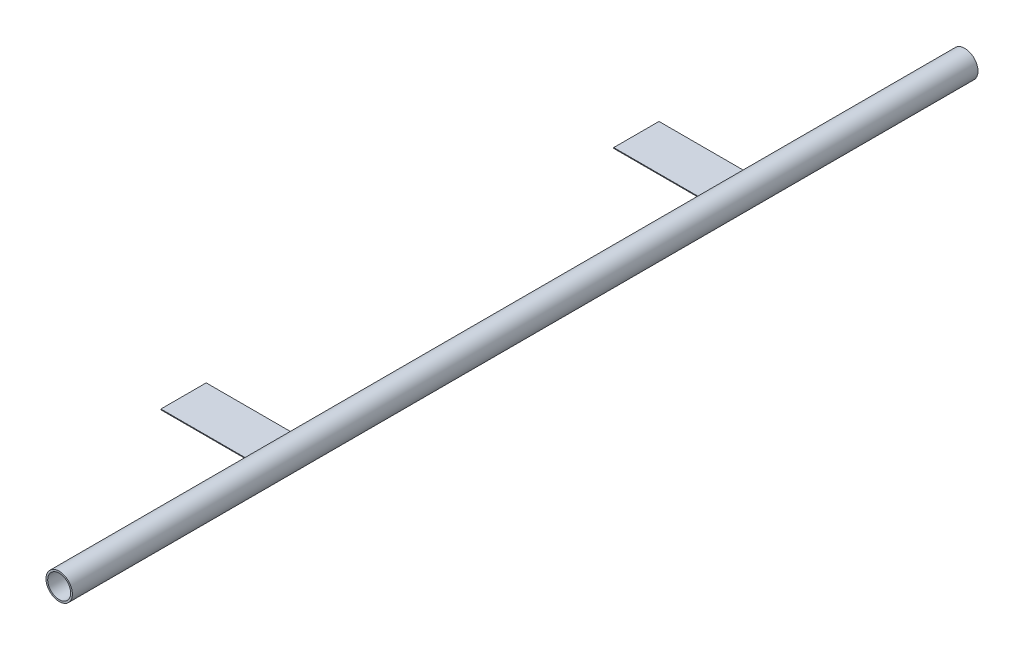
ISO-10303-21;
HEADER;
FILE_DESCRIPTION(('STEP AP214'),'2;1');
FILE_NAME('part.step','',(''),(''),'','','');
FILE_SCHEMA(('AUTOMOTIVE_DESIGN { 1 0 10303 214 1 1 1 1 }'));
ENDSEC;
DATA;
#1=APPLICATION_CONTEXT('core data for automotive mechanical design processes');
#2=APPLICATION_PROTOCOL_DEFINITION('international standard','automotive_design',2000,#1);
#3=PRODUCT_CONTEXT('',#1,'mechanical');
#4=PRODUCT('Part','Part','',(#3));
#5=PRODUCT_RELATED_PRODUCT_CATEGORY('part','',(#4));
#6=PRODUCT_DEFINITION_FORMATION('','',#4);
#7=PRODUCT_DEFINITION_CONTEXT('part definition',#1,'design');
#8=PRODUCT_DEFINITION('design','',#6,#7);
#9=PRODUCT_DEFINITION_SHAPE('','',#8);
#10=(LENGTH_UNIT() NAMED_UNIT(*) SI_UNIT(.MILLI.,.METRE.));
#11=(NAMED_UNIT(*) PLANE_ANGLE_UNIT() SI_UNIT($,.RADIAN.));
#12=(NAMED_UNIT(*) SI_UNIT($,.STERADIAN.) SOLID_ANGLE_UNIT());
#13=UNCERTAINTY_MEASURE_WITH_UNIT(LENGTH_MEASURE(1.E-05),#10,'distance_accuracy_value','');
#14=(GEOMETRIC_REPRESENTATION_CONTEXT(3) GLOBAL_UNCERTAINTY_ASSIGNED_CONTEXT((#13)) GLOBAL_UNIT_ASSIGNED_CONTEXT((#10,
#11,#12)) REPRESENTATION_CONTEXT('',''));
#15=CARTESIAN_POINT('',(0.,0.,0.));
#16=DIRECTION('',(0.,0.,1.));
#17=DIRECTION('',(1.,0.,0.));
#18=AXIS2_PLACEMENT_3D('',#15,#16,#17);
#19=CARTESIAN_POINT('',(0.,0.,3048.));
#20=DIRECTION('',(0.,0.,-1.));
#21=DIRECTION('',(-1.,0.,0.));
#22=AXIS2_PLACEMENT_3D('',#19,#20,#21);
#23=CYLINDRICAL_SURFACE('',#22,44.45);
#24=CARTESIAN_POINT('',(0.,0.,2209.8));
#25=DIRECTION('',(0.,0.,1.));
#26=DIRECTION('',(1.,0.,0.));
#27=AXIS2_PLACEMENT_3D('',#24,#25,#26);
#28=CIRCLE('',#27,44.45);
#29=CARTESIAN_POINT('',(-44.3773692325266,2.54,2209.8));
#30=VERTEX_POINT('',#29);
#31=CARTESIAN_POINT('',(-44.45,0.,2209.8));
#32=VERTEX_POINT('',#31);
#33=EDGE_CURVE('E48',#30,#32,#28,.T.);
#34=ORIENTED_EDGE('',*,*,#33,.F.);
#35=DIRECTION('',(0.,0.,-1.));
#36=VECTOR('',#35,1.);
#37=CARTESIAN_POINT('',(-44.3773692325266,2.54,3048.));
#38=LINE('',#37,#36);
#39=CARTESIAN_POINT('',(-44.3773692325266,2.54,2362.2));
#40=VERTEX_POINT('',#39);
#41=EDGE_CURVE('E11',#30,#40,#38,.F.);
#42=ORIENTED_EDGE('',*,*,#41,.T.);
#43=CARTESIAN_POINT('',(0.,0.,2362.2));
#44=DIRECTION('',(0.,0.,-1.));
#45=DIRECTION('',(-1.,0.,0.));
#46=AXIS2_PLACEMENT_3D('',#43,#44,#45);
#47=CIRCLE('',#46,44.45);
#48=CARTESIAN_POINT('',(-44.45,0.,2362.2));
#49=VERTEX_POINT('',#48);
#50=EDGE_CURVE('E129',#49,#40,#47,.T.);
#51=ORIENTED_EDGE('',*,*,#50,.F.);
#52=DIRECTION('',(0.,0.,-1.));
#53=VECTOR('',#52,1.);
#54=CARTESIAN_POINT('',(-44.45,0.,3048.));
#55=LINE('',#54,#53);
#56=EDGE_CURVE('E111',#32,#49,#55,.F.);
#57=ORIENTED_EDGE('',*,*,#56,.F.);
#58=EDGE_LOOP('',(#34,#42,#51,#57));
#59=FACE_BOUND('',#58,.T.);
#60=CARTESIAN_POINT('',(0.,0.,0.));
#61=DIRECTION('',(0.,0.,1.));
#62=DIRECTION('',(1.,0.,0.));
#63=AXIS2_PLACEMENT_3D('',#60,#61,#62);
#64=CIRCLE('',#63,44.45);
#65=CARTESIAN_POINT('',(44.45,0.,0.));
#66=VERTEX_POINT('',#65);
#67=EDGE_CURVE('E190',#66,#66,#64,.T.);
#68=ORIENTED_EDGE('',*,*,#67,.T.);
#69=EDGE_LOOP('',(#68));
#70=FACE_BOUND('',#69,.T.);
#71=CARTESIAN_POINT('',(0.,0.,3048.));
#72=DIRECTION('',(0.,0.,1.));
#73=DIRECTION('',(1.,0.,0.));
#74=AXIS2_PLACEMENT_3D('',#71,#72,#73);
#75=CIRCLE('',#74,44.45);
#76=CARTESIAN_POINT('',(44.45,0.,3048.));
#77=VERTEX_POINT('',#76);
#78=EDGE_CURVE('E192',#77,#77,#75,.T.);
#79=ORIENTED_EDGE('',*,*,#78,.F.);
#80=EDGE_LOOP('',(#79));
#81=FACE_BOUND('',#80,.T.);
#82=CARTESIAN_POINT('',(-44.45,0.,1816.1));
#83=CARTESIAN_POINT('',(-44.4499994094419,0.349124976126197,1816.10000095291));
#84=CARTESIAN_POINT('',(-44.4458768510917,0.698267379448736,1816.11440821225));
#85=CARTESIAN_POINT('',(-44.4294988891921,1.39400101326506,1816.17191143551));
#86=CARTESIAN_POINT('',(-44.4172429435988,1.74059207216968,1816.2150093115));
#87=CARTESIAN_POINT('',(-44.3849309543297,2.42880969481117,1816.3295304269));
#88=CARTESIAN_POINT('',(-44.364872323751,2.77043457305225,1816.40096306058));
#89=CARTESIAN_POINT('',(-44.3175037645278,3.44616991307207,1816.57153546925));
#90=CARTESIAN_POINT('',(-44.2901939292375,3.78028047153231,1816.67067488754));
#91=CARTESIAN_POINT('',(-44.2291042018982,4.43822660429691,1816.89567907866));
#92=CARTESIAN_POINT('',(-44.1953335533795,4.76207609677702,1817.02150569753));
#93=CARTESIAN_POINT('',(-44.1221947878867,5.39785439954446,1817.29897943833));
#94=CARTESIAN_POINT('',(-44.0828266592826,5.70978318506237,1817.4506266139));
#95=CARTESIAN_POINT('',(-43.9995301115296,6.31969833851184,1817.77859838217));
#96=CARTESIAN_POINT('',(-43.9556021723455,6.61768616908493,1817.95492037829));
#97=CARTESIAN_POINT('',(-43.8643066669765,7.19801545909216,1818.33108448846));
#98=CARTESIAN_POINT('',(-43.8169378776995,7.48035129133255,1818.53093498182));
#99=CARTESIAN_POINT('',(-43.7188564895558,8.03398876919602,1818.95774188317));
#100=CARTESIAN_POINT('',(-43.6680914777267,8.30487534689932,1819.18522479941));
#101=CARTESIAN_POINT('',(-43.5656228311395,8.82664787461659,1819.66188443381));
#102=CARTESIAN_POINT('',(-43.5139191817067,9.07753351160177,1819.91106149136));
#103=CARTESIAN_POINT('',(-43.4109616296781,9.55778499885215,1820.42959599436));
#104=CARTESIAN_POINT('',(-43.3597078760072,9.78714395005912,1820.69895986004));
#105=CARTESIAN_POINT('',(-43.2590960141507,10.2226739561877,1821.25600299161));
#106=CARTESIAN_POINT('',(-43.2097372555813,10.4288530144176,1821.5436758819));
#107=CARTESIAN_POINT('',(-43.1133104450408,10.8206517530001,1822.14163409086));
#108=CARTESIAN_POINT('',(-43.0663093490097,11.0057683434778,1822.45226018551));
#109=CARTESIAN_POINT('',(-42.9771103716092,11.3490951717419,1823.08871509373));
#110=CARTESIAN_POINT('',(-42.9349125716722,11.5073049533879,1823.41454416491));
#111=CARTESIAN_POINT('',(-42.8566280826421,11.7955178832089,1824.079099031));
#112=CARTESIAN_POINT('',(-42.8205403693624,11.9255257596807,1824.41782265281));
#113=CARTESIAN_POINT('',(-42.7556140069083,12.15624747597,1825.10577976983));
#114=CARTESIAN_POINT('',(-42.7267751257516,12.256962253263,1825.45501292831));
#115=CARTESIAN_POINT('',(-42.6779200787544,12.4259881778146,1826.15232116981));
#116=CARTESIAN_POINT('',(-42.6576967213501,12.4950637062778,1826.50019650238));
#117=CARTESIAN_POINT('',(-42.6256636004402,12.6039094246941,1827.20088726731));
#118=CARTESIAN_POINT('',(-42.613853705581,12.6436800721639,1827.55370262245));
#119=CARTESIAN_POINT('',(-42.5990288336653,12.6935385863915,1828.26154230964));
#120=CARTESIAN_POINT('',(-42.5960121955998,12.7036320590449,1828.6165662118));
#121=CARTESIAN_POINT('',(-42.5988671692687,12.6940554344367,1829.32617273209));
#122=CARTESIAN_POINT('',(-42.6047386110387,12.6743859063251,1829.68075535852));
#123=CARTESIAN_POINT('',(-42.6248461041546,12.6065929482021,1830.37530652146));
#124=CARTESIAN_POINT('',(-42.6388044334019,12.5594139260849,1830.71537580515));
#125=CARTESIAN_POINT('',(-42.6744420893893,12.4377852719432,1831.39017990467));
#126=CARTESIAN_POINT('',(-42.69612122426,12.3633363176016,1831.72491485284));
#127=CARTESIAN_POINT('',(-42.7465630956684,12.1877878155933,1832.38679028464));
#128=CARTESIAN_POINT('',(-42.7753262709506,12.0866866172138,1832.71393029651));
#129=CARTESIAN_POINT('',(-42.8391068819173,11.8586435311775,1833.3584462346));
#130=CARTESIAN_POINT('',(-42.8741244435022,11.7317011233318,1833.67582196411));
#131=CARTESIAN_POINT('',(-42.9499069977302,11.4511725162324,1834.30273229123));
#132=CARTESIAN_POINT('',(-42.9907390082692,11.2972699891572,1834.61211718375));
#133=CARTESIAN_POINT('',(-43.0766659551307,10.9650704733272,1835.21687284538));
#134=CARTESIAN_POINT('',(-43.1217609098922,10.7867733790536,1835.51224355387));
#135=CARTESIAN_POINT('',(-43.214993897272,10.406970260801,1836.08722895521));
#136=CARTESIAN_POINT('',(-43.2631324581298,10.2054602030313,1836.36684089701));
#137=CARTESIAN_POINT('',(-43.3611669260551,9.78055381197331,1836.90859350823));
#138=CARTESIAN_POINT('',(-43.4110629161041,9.55715644433016,1837.17073335097));
#139=CARTESIAN_POINT('',(-43.5132000491619,9.08104593080377,1837.68549972803));
#140=CARTESIAN_POINT('',(-43.5654586735929,8.82754496785317,1837.93739474111));
#141=CARTESIAN_POINT('',(-43.6690149791473,8.30011122116982,1838.41902798474));
#142=CARTESIAN_POINT('',(-43.720312635767,8.02617791731918,1838.6487656509));
#143=CARTESIAN_POINT('',(-43.820535419367,7.45961950600793,1839.08454202978));
#144=CARTESIAN_POINT('',(-43.8694603585998,7.1669929236237,1839.29057886887));
#145=CARTESIAN_POINT('',(-43.9635801984794,6.56497658212721,1839.67745832442));
#146=CARTESIAN_POINT('',(-44.0087752550435,6.25558752461949,1839.85830199423));
#147=CARTESIAN_POINT('',(-44.0944227351352,5.62029168298145,1840.19439265663));
#148=CARTESIAN_POINT('',(-44.1348468973658,5.29430139395536,1840.34948913568));
#149=CARTESIAN_POINT('',(-44.2095048454722,4.62968546304167,1840.63158194462));
#150=CARTESIAN_POINT('',(-44.2437385808783,4.29105971816588,1840.75857804542));
#151=CARTESIAN_POINT('',(-44.3050220573182,3.60368470981783,1840.98335664155));
#152=CARTESIAN_POINT('',(-44.3320732695448,3.25493753577249,1841.08114511999));
#153=CARTESIAN_POINT('',(-44.3782094620071,2.54986544882095,1841.24665830674));
#154=CARTESIAN_POINT('',(-44.3972947038901,2.19354078520625,1841.3143840025));
#155=CARTESIAN_POINT('',(-44.4264496428669,1.48784186434864,1841.41741981067));
#156=CARTESIAN_POINT('',(-44.4367947192116,1.13862340982308,1841.4537210202));
#157=CARTESIAN_POINT('',(-44.449219448824,0.438235911845152,1841.49728516654));
#158=CARTESIAN_POINT('',(-44.4512992830477,0.0870669112658555,1841.50454873909));
#159=CARTESIAN_POINT('',(-44.4471356491359,-0.614576730539139,1841.48997298099));
#160=CARTESIAN_POINT('',(-44.4408930889279,-0.965051443330635,1841.46813682496));
#161=CARTESIAN_POINT('',(-44.4202607169409,-1.6627507352569,1841.39556551081));
#162=CARTESIAN_POINT('',(-44.405870954192,-2.00997533393818,1841.34483052659));
#163=CARTESIAN_POINT('',(-44.3697139971179,-2.69168014363096,1841.21622885623));
#164=CARTESIAN_POINT('',(-44.3481016767682,-3.0262761132517,1841.13893085264));
#165=CARTESIAN_POINT('',(-44.2980120524893,-3.68762891285117,1840.95767053001));
#166=CARTESIAN_POINT('',(-44.2695348678046,-4.0143858788869,1840.85370867411));
#167=CARTESIAN_POINT('',(-44.2064556850375,-4.6579319058965,1840.61993587892));
#168=CARTESIAN_POINT('',(-44.1718531842887,-4.97472014628462,1840.49012281806));
#169=CARTESIAN_POINT('',(-44.0974155664936,-5.59628710010197,1840.20563016376));
#170=CARTESIAN_POINT('',(-44.057580330561,-5.90106554046763,1840.05095000532));
#171=CARTESIAN_POINT('',(-43.9727820607284,-6.50318130847991,1839.71421894474));
#172=CARTESIAN_POINT('',(-43.9277267244167,-6.80021493866368,1839.53164822773));
#173=CARTESIAN_POINT('',(-43.8343957494089,-7.37793229184965,1839.14298441699));
#174=CARTESIAN_POINT('',(-43.7861200738095,-7.6586158274189,1838.93689105369));
#175=CARTESIAN_POINT('',(-43.6876006736836,-8.20196986913567,1838.50250967738));
#176=CARTESIAN_POINT('',(-43.6373565600862,-8.46463678570362,1838.27421726327));
#177=CARTESIAN_POINT('',(-43.5362235590521,-8.97029737595411,1837.79692430348));
#178=CARTESIAN_POINT('',(-43.4853346608591,-9.21329072094242,1837.54792341196));
#179=CARTESIAN_POINT('',(-43.3825966864726,-9.68571890573686,1837.02227294292));
#180=CARTESIAN_POINT('',(-43.3307707492019,-9.91444903884761,1836.74498492452));
#181=CARTESIAN_POINT('',(-43.2293385347126,-10.3477690223316,1836.1717549127));
#182=CARTESIAN_POINT('',(-43.1797323108092,-10.5523582930594,1835.87581247163));
#183=CARTESIAN_POINT('',(-43.0841849919749,-10.9359308837687,1835.26720891409));
#184=CARTESIAN_POINT('',(-43.0382438608983,-11.1149144562915,1834.95454796256));
#185=CARTESIAN_POINT('',(-42.9513998621207,-11.4459182497445,1834.3145920062));
#186=CARTESIAN_POINT('',(-42.9104969127041,-11.5979389080102,1833.98729723884));
#187=CARTESIAN_POINT('',(-42.8351885726294,-11.8730521459899,1833.32210967949));
#188=CARTESIAN_POINT('',(-42.8007496167686,-11.9962950226126,1832.98428289445));
#189=CARTESIAN_POINT('',(-42.7391791571089,-12.2138389167996,1832.29877734452));
#190=CARTESIAN_POINT('',(-42.7120476521782,-12.3081399388466,1831.95109858116));
#191=CARTESIAN_POINT('',(-42.6659711358513,-12.4669263138403,1831.24855249586));
#192=CARTESIAN_POINT('',(-42.6470240454284,-12.531419239011,1830.89368702352));
#193=CARTESIAN_POINT('',(-42.6179298742622,-12.6300122203345,1830.1794048148));
#194=CARTESIAN_POINT('',(-42.6077824978794,-12.6641132975483,1829.81998823172));
#195=CARTESIAN_POINT('',(-42.5968346596554,-12.7008865356925,1829.11304156205));
#196=CARTESIAN_POINT('',(-42.5956955256492,-12.7046975064124,1828.76557546139));
#197=CARTESIAN_POINT('',(-42.6019096617444,-12.6838446009738,1828.07158139496));
#198=CARTESIAN_POINT('',(-42.6092627067403,-12.6591814795887,1827.72505340456));
#199=CARTESIAN_POINT('',(-42.6322332286169,-12.5816063588106,1827.03546965475));
#200=CARTESIAN_POINT('',(-42.6478503803785,-12.5286954707154,1826.69241375927));
#201=CARTESIAN_POINT('',(-42.6868712914339,-12.3950939121327,1826.01220854341));
#202=CARTESIAN_POINT('',(-42.7102750891235,-12.3144031046632,1825.67505925215));
#203=CARTESIAN_POINT('',(-42.7638898904009,-12.1268964184675,1825.012423836));
#204=CARTESIAN_POINT('',(-42.7940286895429,-12.0203566915063,1824.68685360383));
#205=CARTESIAN_POINT('',(-42.8603792908823,-11.7815842698024,1824.04592549703));
#206=CARTESIAN_POINT('',(-42.8965910260117,-11.6493518588012,1823.73056750966));
#207=CARTESIAN_POINT('',(-42.974074038942,-11.3601870610428,1823.11205740642));
#208=CARTESIAN_POINT('',(-43.0153451027386,-11.2032557189452,1822.80890477499));
#209=CARTESIAN_POINT('',(-43.1018423559154,-10.8657275882322,1822.21651865919));
#210=CARTESIAN_POINT('',(-43.147070058593,-10.6851217315361,1821.92729056669));
#211=CARTESIAN_POINT('',(-43.2418079085436,-10.2951500748957,1821.35529623005));
#212=CARTESIAN_POINT('',(-43.2914101033704,-10.0850321380387,1821.07305779977));
#213=CARTESIAN_POINT('',(-43.3921955814127,-9.64217003270823,1820.52702049588));
#214=CARTESIAN_POINT('',(-43.4433795774497,-9.40941555882146,1820.26323011568));
#215=CARTESIAN_POINT('',(-43.5459306570317,-8.92279393503267,1819.75581157484));
#216=CARTESIAN_POINT('',(-43.5972977819285,-8.66892168389612,1819.51218831432));
#217=CARTESIAN_POINT('',(-43.6988008522779,-8.14182378656368,1819.04683385498));
#218=CARTESIAN_POINT('',(-43.7489373297905,-7.86860670972887,1818.8250930656));
#219=CARTESIAN_POINT('',(-43.8479422150279,-7.29703699105795,1818.39934963487));
#220=CARTESIAN_POINT('',(-43.8967432250667,-6.99821401669774,1818.19596212457));
#221=CARTESIAN_POINT('',(-43.9902707734379,-6.38396706325587,1817.81521600938));
#222=CARTESIAN_POINT('',(-44.0349988187191,-6.06854929276238,1817.63784776272));
#223=CARTESIAN_POINT('',(-44.1191202227436,-5.42324325827697,1817.31047009284));
#224=CARTESIAN_POINT('',(-44.1585150204253,-5.09335892936769,1817.16045328627));
#225=CARTESIAN_POINT('',(-44.2308493366209,-4.42138061356254,1816.88896855868));
#226=CARTESIAN_POINT('',(-44.2637895875342,-4.07928801715578,1816.76749739828));
#227=CARTESIAN_POINT('',(-44.3183970621499,-3.43125850001422,1816.56824942378));
#228=CARTESIAN_POINT('',(-44.3409786629686,-3.12651572699343,1816.48682016769));
#229=CARTESIAN_POINT('',(-44.3800706606552,-2.5113390874558,1816.34677934513));
#230=CARTESIAN_POINT('',(-44.3965792532563,-2.20090355835547,1816.28817455944));
#231=CARTESIAN_POINT('',(-44.4231416887084,-1.57628743412784,1816.19424537784));
#232=CARTESIAN_POINT('',(-44.4331961890565,-1.26210722380457,1816.15891861053));
#233=CARTESIAN_POINT('',(-44.4466245000016,-0.631955679975282,1816.1117994075));
#234=CARTESIAN_POINT('',(-44.4500005345006,-0.31598497785648,1816.09999913754));
#235=CARTESIAN_POINT('',(-44.45,0.,1816.1));
#236=B_SPLINE_CURVE_WITH_KNOTS('',3,(#82,#83,#84,#85,#86,#87,#88,#89,#90,#91,#92,#93,#94,#95,
#96,#97,#98,#99,#100,#101,#102,#103,#104,#105,#106,#107,#108,#109,#110,#111,#112,#113,#114,#115,
#116,#117,#118,#119,#120,#121,#122,#123,#124,#125,#126,#127,#128,#129,#130,#131,#132,#133,#134,
#135,#136,#137,#138,#139,#140,#141,#142,#143,#144,#145,#146,#147,#148,#149,#150,#151,#152,#153,
#154,#155,#156,#157,#158,#159,#160,#161,#162,#163,#164,#165,#166,#167,#168,#169,#170,#171,#172,
#173,#174,#175,#176,#177,#178,#179,#180,#181,#182,#183,#184,#185,#186,#187,#188,#189,#190,#191,
#192,#193,#194,#195,#196,#197,#198,#199,#200,#201,#202,#203,#204,#205,#206,#207,#208,#209,#210,
#211,#212,#213,#214,#215,#216,#217,#218,#219,#220,#221,#222,#223,#224,#225,#226,#227,#228,#229,
#230,#231,#232,#233,#234,#235),.UNSPECIFIED.,.T.,.F.,(4,2,2,2,2,2,2,2,2,2,2,2,2,2,2,2,2,2,2,2,2,
2,2,2,2,2,2,2,2,2,2,2,2,2,2,2,2,2,2,2,2,2,2,2,2,2,2,2,2,2,2,2,2,2,2,2,2,2,2,2,2,2,2,2,2,2,2,2,2,
2,2,2,2,2,2,2,4),(0.,1.04708489241769,2.09423957406767,3.141741725765,4.1892303922651,
5.23523146775044,6.2812347165499,7.32712797470255,8.37339484499642,9.44424229514508,
10.5151065015204,11.5863127440927,12.6571479886245,13.7497496908043,14.8423699135868,
15.9348068071781,17.0272087353473,18.0916109828281,19.1559966121804,20.2201811705633,
21.2843453790811,22.3139643330302,23.3435577017387,24.3732148535405,25.4028927346057,
26.4455783555405,27.4882684867598,28.531140083685,29.5740609886409,30.6563104391275,
31.7385874483522,32.8209499563432,33.9032671962784,34.9917042013105,36.0801500798371,
37.1683728402306,38.2565598544479,39.3090260124474,40.3614691280301,41.4137974372489,
42.466119413587,43.4971873606692,44.5282373991425,45.5593720887042,46.5905302093845,
47.6439999533018,48.6974817715275,49.7511728764131,50.8048815821071,51.8931006814999,
52.9813459047722,54.0695803942655,55.1577972311046,56.2401967752883,57.3225961518188,
58.4047204124421,59.4868083160571,60.5280112343991,61.5691865538162,62.6103209152842,
63.6514604106343,64.6819322661994,65.7123927422258,66.7428096458715,67.7736223910848,
68.8384359564123,69.9037365738538,70.9692952780218,72.0343848795829,73.1273137616383,
74.2198366158266,75.3120641116006,76.4041676001416,77.3519909987595,78.3000957649967,
79.2481039297274,80.1957963584262),.UNSPECIFIED.);
#237=CARTESIAN_POINT('',(-44.45,0.,1816.1));
#238=VERTEX_POINT('',#237);
#239=EDGE_CURVE('E161',#238,#238,#236,.T.);
#240=ORIENTED_EDGE('',*,*,#239,.T.);
#241=EDGE_LOOP('',(#240));
#242=FACE_BOUND('',#241,.T.);
#243=DIRECTION('',(0.,0.,-1.));
#244=VECTOR('',#243,1.);
#245=CARTESIAN_POINT('',(-44.3773692325266,2.54,3048.));
#246=LINE('',#245,#244);
#247=CARTESIAN_POINT('',(-44.3773692325266,2.54,838.2));
#248=VERTEX_POINT('',#247);
#249=CARTESIAN_POINT('',(-44.3773692325266,2.54,685.8));
#250=VERTEX_POINT('',#249);
#251=EDGE_CURVE('E42',#248,#250,#246,.T.);
#252=ORIENTED_EDGE('',*,*,#251,.F.);
#253=CARTESIAN_POINT('',(0.,0.,838.2));
#254=DIRECTION('',(0.,0.,-1.));
#255=DIRECTION('',(-1.,0.,0.));
#256=AXIS2_PLACEMENT_3D('',#253,#254,#255);
#257=CIRCLE('',#256,44.45);
#258=CARTESIAN_POINT('',(-44.45,0.,838.2));
#259=VERTEX_POINT('',#258);
#260=EDGE_CURVE('E155',#259,#248,#257,.T.);
#261=ORIENTED_EDGE('',*,*,#260,.F.);
#262=DIRECTION('',(0.,0.,-1.));
#263=VECTOR('',#262,1.);
#264=CARTESIAN_POINT('',(-44.45,0.,3048.));
#265=LINE('',#264,#263);
#266=CARTESIAN_POINT('',(-44.45,0.,685.8));
#267=VERTEX_POINT('',#266);
#268=EDGE_CURVE('E152',#259,#267,#265,.T.);
#269=ORIENTED_EDGE('',*,*,#268,.T.);
#270=CARTESIAN_POINT('',(0.,0.,685.8));
#271=DIRECTION('',(0.,0.,1.));
#272=DIRECTION('',(1.,0.,0.));
#273=AXIS2_PLACEMENT_3D('',#270,#271,#272);
#274=CIRCLE('',#273,44.45);
#275=EDGE_CURVE('E157',#250,#267,#274,.T.);
#276=ORIENTED_EDGE('',*,*,#275,.F.);
#277=EDGE_LOOP('',(#252,#261,#269,#276));
#278=FACE_BOUND('',#277,.T.);
#279=ADVANCED_FACE('F34',(#59,#70,#81,#242,#278),#23,.T.);
#280=CARTESIAN_POINT('',(0.,0.,3048.));
#281=DIRECTION('',(0.,0.,1.));
#282=DIRECTION('',(1.,0.,0.));
#283=AXIS2_PLACEMENT_3D('',#280,#281,#282);
#284=PLANE('',#283);
#285=ORIENTED_EDGE('',*,*,#78,.T.);
#286=EDGE_LOOP('',(#285));
#287=FACE_BOUND('',#286,.T.);
#288=CARTESIAN_POINT('',(0.,0.,3048.));
#289=DIRECTION('',(0.,0.,1.));
#290=DIRECTION('',(1.,0.,0.));
#291=AXIS2_PLACEMENT_3D('',#288,#289,#290);
#292=CIRCLE('',#291,38.6334);
#293=CARTESIAN_POINT('',(38.6334,0.,3048.));
#294=VERTEX_POINT('',#293);
#295=EDGE_CURVE('E169',#294,#294,#292,.T.);
#296=ORIENTED_EDGE('',*,*,#295,.F.);
#297=EDGE_LOOP('',(#296));
#298=FACE_BOUND('',#297,.T.);
#299=ADVANCED_FACE('F208',(#287,#298),#284,.T.);
#300=CARTESIAN_POINT('',(0.,0.,0.));
#301=DIRECTION('',(0.,0.,1.));
#302=DIRECTION('',(1.,0.,0.));
#303=AXIS2_PLACEMENT_3D('',#300,#301,#302);
#304=PLANE('',#303);
#305=ORIENTED_EDGE('',*,*,#67,.F.);
#306=EDGE_LOOP('',(#305));
#307=FACE_BOUND('',#306,.T.);
#308=CARTESIAN_POINT('',(0.,0.,0.));
#309=DIRECTION('',(0.,0.,1.));
#310=DIRECTION('',(1.,0.,0.));
#311=AXIS2_PLACEMENT_3D('',#308,#309,#310);
#312=CIRCLE('',#311,38.6334);
#313=CARTESIAN_POINT('',(38.6334,0.,0.));
#314=VERTEX_POINT('',#313);
#315=EDGE_CURVE('E168',#314,#314,#312,.T.);
#316=ORIENTED_EDGE('',*,*,#315,.T.);
#317=EDGE_LOOP('',(#316));
#318=FACE_BOUND('',#317,.T.);
#319=ADVANCED_FACE('F210',(#307,#318),#304,.F.);
#320=CARTESIAN_POINT('',(0.,0.,3048.));
#321=DIRECTION('',(0.,0.,-1.));
#322=DIRECTION('',(-1.,0.,0.));
#323=AXIS2_PLACEMENT_3D('',#320,#321,#322);
#324=CYLINDRICAL_SURFACE('',#323,38.6334);
#325=CARTESIAN_POINT('',(-38.6334,0.,1841.5));
#326=CARTESIAN_POINT('',(-38.6334000039492,-0.346749338226398,1841.50000001114));
#327=CARTESIAN_POINT('',(-38.6287209409042,-0.693498648043852,1841.48578757331));
#328=CARTESIAN_POINT('',(-38.6101334110631,-1.38442354385969,1841.42907445208));
#329=CARTESIAN_POINT('',(-38.5962249471068,-1.72859913064994,1841.38657377739));
#330=CARTESIAN_POINT('',(-38.5595569296195,-2.41189664698293,1841.27367950786));
#331=CARTESIAN_POINT('',(-38.5367964662917,-2.75101805334255,1841.20328304592));
#332=CARTESIAN_POINT('',(-38.4830393915115,-3.42176630036423,1841.03523828396));
#333=CARTESIAN_POINT('',(-38.4520427409038,-3.7533931053884,1840.93758985438));
#334=CARTESIAN_POINT('',(-38.3826964121376,-4.40633984271219,1840.71607428511));
#335=CARTESIAN_POINT('',(-38.3443592107487,-4.72767619918824,1840.59225159732));
#336=CARTESIAN_POINT('',(-38.2612968624588,-5.35854409553486,1840.31929404355));
#337=CARTESIAN_POINT('',(-38.2165717305056,-5.66807566302644,1840.1701592368));
#338=CARTESIAN_POINT('',(-38.1218795994002,-6.27341632221138,1839.84770794922));
#339=CARTESIAN_POINT('',(-38.0719127519059,-6.56922581056664,1839.67439216797));
#340=CARTESIAN_POINT('',(-37.9679787698537,-7.1454845262952,1839.30472662575));
#341=CARTESIAN_POINT('',(-37.9140102031759,-7.42592819156072,1839.10836860372));
#342=CARTESIAN_POINT('',(-37.8017620750309,-7.97797655860391,1838.68766629216));
#343=CARTESIAN_POINT('',(-37.7434014481833,-8.24905620945727,1838.46265444392));
#344=CARTESIAN_POINT('',(-37.625429010008,-8.77145428855766,1837.99105135593));
#345=CARTESIAN_POINT('',(-37.5658171717802,-9.02277229139323,1837.74445965186));
#346=CARTESIAN_POINT('',(-37.4469113138865,-9.50420661489644,1837.23112818344));
#347=CARTESIAN_POINT('',(-37.3876174223779,-9.73431491465217,1836.96438086564));
#348=CARTESIAN_POINT('',(-37.2710001969139,-10.1716941634737,1836.41252639132));
#349=CARTESIAN_POINT('',(-37.2136761934094,-10.378972926008,1836.12742556961));
#350=CARTESIAN_POINT('',(-37.1010103132992,-10.7748868882658,1835.53224413984));
#351=CARTESIAN_POINT('',(-37.0457692758125,-10.9628352462364,1835.22168692889));
#352=CARTESIAN_POINT('',(-36.9407097575414,-11.3117983644364,1834.58489725794));
#353=CARTESIAN_POINT('',(-36.8908914032496,-11.4728124964298,1834.25866443253));
#354=CARTESIAN_POINT('',(-36.7982612274127,-11.7665327354712,1833.59281512911));
#355=CARTESIAN_POINT('',(-36.7554477898642,-11.8992453736983,1833.25320176043));
#356=CARTESIAN_POINT('',(-36.6782208398249,-12.1352026921523,1832.56295951911));
#357=CARTESIAN_POINT('',(-36.6438069608545,-12.2384486580675,1832.21233112783));
#358=CARTESIAN_POINT('',(-36.5855242069434,-12.4115705706121,1831.51438874141));
#359=CARTESIAN_POINT('',(-36.5613457005116,-12.4824324784559,1831.16734510891));
#360=CARTESIAN_POINT('',(-36.5227328249927,-12.5949646816284,1830.468017536));
#361=CARTESIAN_POINT('',(-36.508298258596,-12.6366355680605,1830.11573370185));
#362=CARTESIAN_POINT('',(-36.4896603703796,-12.6903543486358,1829.4087355151));
#363=CARTESIAN_POINT('',(-36.4854544020764,-12.7024099052725,1829.05402181501));
#364=CARTESIAN_POINT('',(-36.4874092481242,-12.6967938803788,1828.34486365193));
#365=CARTESIAN_POINT('',(-36.493569780363,-12.6791231078159,1827.99041918188));
#366=CARTESIAN_POINT('',(-36.5155472759553,-12.6156829467448,1827.30024492052));
#367=CARTESIAN_POINT('',(-36.5309238072246,-12.5711946403075,1826.96438236296));
#368=CARTESIAN_POINT('',(-36.5704787825132,-12.4556573722388,1826.29779809926));
#369=CARTESIAN_POINT('',(-36.5946569276892,-12.3846093123947,1825.96707621896));
#370=CARTESIAN_POINT('',(-36.6510946729725,-12.2165746975685,1825.31297557636));
#371=CARTESIAN_POINT('',(-36.6833549232228,-12.1195860558241,1824.98959740709));
#372=CARTESIAN_POINT('',(-36.7550196341235,-11.9004789860794,1824.35228686454));
#373=CARTESIAN_POINT('',(-36.7944242798557,-11.778359907042,1824.03835473623));
#374=CARTESIAN_POINT('',(-36.8799329307777,-11.5078479479011,1823.41706290877));
#375=CARTESIAN_POINT('',(-36.9261316204343,-11.3590758846277,1823.10988143261));
#376=CARTESIAN_POINT('',(-37.0234872572653,-11.0376258833856,1822.50897713864));
#377=CARTESIAN_POINT('',(-37.074646030119,-10.8649391329394,1822.21525933551));
#378=CARTESIAN_POINT('',(-37.1805226972565,-10.4969030059634,1821.64313593884));
#379=CARTESIAN_POINT('',(-37.2352400068153,-10.3015573485441,1821.36472784349));
#380=CARTESIAN_POINT('',(-37.3468411600557,-9.88932056849727,1820.82461191853));
#381=CARTESIAN_POINT('',(-37.4037259934261,-9.67241952922759,1820.56291186731));
#382=CARTESIAN_POINT('',(-37.5211008744004,-9.20690356146673,1820.0449883305));
#383=CARTESIAN_POINT('',(-37.5816273952785,-8.95723788071606,1819.78971652329));
#384=CARTESIAN_POINT('',(-37.7017593238869,-8.43730339972329,1819.30109836062));
#385=CARTESIAN_POINT('',(-37.7613651062881,-8.1670432604908,1819.0677428794));
#386=CARTESIAN_POINT('',(-37.8780886089404,-7.60734813567375,1818.62425430488));
#387=CARTESIAN_POINT('',(-37.9352050071142,-7.31790316211052,1818.41413346227));
#388=CARTESIAN_POINT('',(-38.0453352851396,-6.72189310301205,1818.01881381761));
#389=CARTESIAN_POINT('',(-38.0983508085687,-6.41533496191752,1817.83360500892));
#390=CARTESIAN_POINT('',(-38.1993340922635,-5.78391378907761,1817.48774283778));
#391=CARTESIAN_POINT('',(-38.2472480424392,-5.45890233183475,1817.32734443419));
#392=CARTESIAN_POINT('',(-38.3360715935955,-4.79553747563058,1817.03461640079));
#393=CARTESIAN_POINT('',(-38.3769811085598,-4.4571839128877,1816.90228711569));
#394=CARTESIAN_POINT('',(-38.4506007471855,-3.76966533920944,1816.66692114938));
#395=CARTESIAN_POINT('',(-38.4833131146514,-3.42050331633932,1816.56387645108));
#396=CARTESIAN_POINT('',(-38.5395871092148,-2.71392602527939,1816.3880247043));
#397=CARTESIAN_POINT('',(-38.5631491447278,-2.35651112620257,1816.31521630625));
#398=CARTESIAN_POINT('',(-38.5996303660348,-1.65148981921249,1816.20299417255));
#399=CARTESIAN_POINT('',(-38.6129576674574,-1.30410822568165,1816.16229785858));
#400=CARTESIAN_POINT('',(-38.6302055800158,-0.606942209330041,1816.10969617499));
#401=CARTESIAN_POINT('',(-38.6341264567504,-0.257157854633084,1816.09778999247));
#402=CARTESIAN_POINT('',(-38.6324521507328,0.442124161504452,1816.10288349152));
#403=CARTESIAN_POINT('',(-38.6268583597932,0.791621857395709,1816.11987894533));
#404=CARTESIAN_POINT('',(-38.6063136246464,1.48774811302827,1816.18260195619));
#405=CARTESIAN_POINT('',(-38.5913627705431,1.83437670036512,1816.22832923655));
#406=CARTESIAN_POINT('',(-38.5530660202232,2.51252805680294,1816.3463932527));
#407=CARTESIAN_POINT('',(-38.5299676795792,2.84420166917707,1816.41794663144));
#408=CARTESIAN_POINT('',(-38.4759250091787,3.50015593797939,1816.58715295094));
#409=CARTESIAN_POINT('',(-38.4449808666684,3.82443677064085,1816.68480526882));
#410=CARTESIAN_POINT('',(-38.3760384911574,4.46346809848421,1816.9053918814));
#411=CARTESIAN_POINT('',(-38.3380408893864,4.77821944355192,1817.02832391387));
#412=CARTESIAN_POINT('',(-38.2559269508624,5.39637994677665,1817.29856870298));
#413=CARTESIAN_POINT('',(-38.2118083019304,5.69978476362666,1817.44589067682));
#414=CARTESIAN_POINT('',(-38.1173521560266,6.30095295374975,1817.76789997599));
#415=CARTESIAN_POINT('',(-38.0668840674067,6.59837144466208,1817.94319282122));
#416=CARTESIAN_POINT('',(-37.9619539697452,7.17748311930097,1818.31703606862));
#417=CARTESIAN_POINT('',(-37.9074917248712,7.45917537274954,1818.5155878445));
#418=CARTESIAN_POINT('',(-37.7959430545177,8.00524653273105,1818.93468126058));
#419=CARTESIAN_POINT('',(-37.7388560181625,8.26962137386166,1819.15522803384));
#420=CARTESIAN_POINT('',(-37.623514485809,8.77946934275997,1819.61690682598));
#421=CARTESIAN_POINT('',(-37.5652599610726,9.02494200452239,1819.85803935205));
#422=CARTESIAN_POINT('',(-37.4464990782513,9.50596470652601,1820.37055521461));
#423=CARTESIAN_POINT('',(-37.3860069993997,9.74059658097769,1820.64280455661));
#424=CARTESIAN_POINT('',(-37.267080802778,10.1861408301452,1821.2064768519));
#425=CARTESIAN_POINT('',(-37.2086466404531,10.3970537186043,1821.49789938968));
#426=CARTESIAN_POINT('',(-37.0955132375358,10.7937510586654,1822.0981799844));
#427=CARTESIAN_POINT('',(-37.0408149593391,10.9795290473016,1822.40704249688));
#428=CARTESIAN_POINT('',(-36.9368315670561,11.3244212005583,1823.04002356237));
#429=CARTESIAN_POINT('',(-36.8875442041054,11.4835464570541,1823.36413569676));
#430=CARTESIAN_POINT('',(-36.7959935783883,11.7735952875718,1824.02482329046));
#431=CARTESIAN_POINT('',(-36.7537147097105,11.9045817167038,1824.36136896165));
#432=CARTESIAN_POINT('',(-36.6774085625787,12.1376419161964,1825.04525061355));
#433=CARTESIAN_POINT('',(-36.6433813081941,12.2397156022206,1825.39258662573));
#434=CARTESIAN_POINT('',(-36.5847271043081,12.4139356599541,1826.09533684799));
#435=CARTESIAN_POINT('',(-36.5600967372248,12.4860929128895,1826.45074807124));
#436=CARTESIAN_POINT('',(-36.5210692916819,12.5997906495696,1827.16698550217));
#437=CARTESIAN_POINT('',(-36.5066717164973,12.641332619459,1827.52781144614));
#438=CARTESIAN_POINT('',(-36.4890652934083,12.6920596555269,1828.23382944591));
#439=CARTESIAN_POINT('',(-36.4853326727658,12.7027596675232,1828.57890043798));
#440=CARTESIAN_POINT('',(-36.4876739929711,12.696033225228,1829.26872749214));
#441=CARTESIAN_POINT('',(-36.4937475908251,12.6786077546864,1829.61348356483));
#442=CARTESIAN_POINT('',(-36.5155058326664,12.6158046082313,1830.30010741336));
#443=CARTESIAN_POINT('',(-36.5311899027792,12.5704286013396,1830.64197536043));
#444=CARTESIAN_POINT('',(-36.5716718794211,12.4521608230427,1831.32036558209));
#445=CARTESIAN_POINT('',(-36.5964698175897,12.3792689561142,1831.65688783812));
#446=CARTESIAN_POINT('',(-36.6538882174362,12.2081960071979,1832.31622793698));
#447=CARTESIAN_POINT('',(-36.6863596441181,12.110494372722,1832.63918346144));
#448=CARTESIAN_POINT('',(-36.7584073795647,11.8900176859799,1833.27558778737));
#449=CARTESIAN_POINT('',(-36.7979835627826,11.7672430767674,1833.5890367567));
#450=CARTESIAN_POINT('',(-36.8831332317913,11.4975674841914,1834.20451951996));
#451=CARTESIAN_POINT('',(-36.9287066588405,11.3506667371339,1834.50655342565));
#452=CARTESIAN_POINT('',(-37.0246394015705,11.0337248943179,1835.09757133681));
#453=CARTESIAN_POINT('',(-37.0750005609113,10.8636748732599,1835.38655025137));
#454=CARTESIAN_POINT('',(-37.1813846653823,10.4939396388485,1835.96163151774));
#455=CARTESIAN_POINT('',(-37.2375569058953,10.293306075739,1836.24709682399));
#456=CARTESIAN_POINT('',(-37.3521463407511,9.86939592121258,1836.80040938944));
#457=CARTESIAN_POINT('',(-37.410564548132,9.64610903585888,1837.06824854713));
#458=CARTESIAN_POINT('',(-37.5280776249198,9.1782977674505,1837.58466054517));
#459=CARTESIAN_POINT('',(-37.5871726664132,8.9337678743606,1837.83322835505));
#460=CARTESIAN_POINT('',(-37.7044475015751,8.42510060087217,1838.30941669032));
#461=CARTESIAN_POINT('',(-37.7626276771805,8.16097168102227,1838.53704616046));
#462=CARTESIAN_POINT('',(-37.878755161213,7.60417009909076,1838.97828661399));
#463=CARTESIAN_POINT('',(-37.9366095148696,7.31079400670903,1839.19103556791));
#464=CARTESIAN_POINT('',(-38.0480880958839,6.70648501852537,1839.59093527404));
#465=CARTESIAN_POINT('',(-38.1017139336992,6.39555888494049,1839.77809579191));
#466=CARTESIAN_POINT('',(-38.2032459928248,5.75810200440095,1840.12545834184));
#467=CARTESIAN_POINT('',(-38.2511523392881,5.43157159911553,1840.28566096381));
#468=CARTESIAN_POINT('',(-38.3398720293802,4.76516162297937,1840.57775734906));
#469=CARTESIAN_POINT('',(-38.380685787339,4.42528283332853,1840.70965276606));
#470=CARTESIAN_POINT('',(-38.4520622515681,3.7531985310558,1840.93765114134));
#471=CARTESIAN_POINT('',(-38.4830578393798,3.42156153194806,1841.03529615671));
#472=CARTESIAN_POINT('',(-38.5368118957201,2.75080010929651,1841.20333107313));
#473=CARTESIAN_POINT('',(-38.5595706996839,2.4116759912553,1841.27372208409));
#474=CARTESIAN_POINT('',(-38.5962329800683,1.7284134778583,1841.3865983288));
#475=CARTESIAN_POINT('',(-38.6101383654132,1.38427617979564,1841.4290895782));
#476=CARTESIAN_POINT('',(-38.628721907165,0.693425924240229,1841.48579051171));
#477=CARTESIAN_POINT('',(-38.6333999960512,0.346712947918623,1841.49999998886));
#478=CARTESIAN_POINT('',(-38.6334,0.,1841.5));
#479=B_SPLINE_CURVE_WITH_KNOTS('',3,(#325,#326,#327,#328,#329,#330,#331,#332,#333,#334,#335,
#336,#337,#338,#339,#340,#341,#342,#343,#344,#345,#346,#347,#348,#349,#350,#351,#352,#353,#354,
#355,#356,#357,#358,#359,#360,#361,#362,#363,#364,#365,#366,#367,#368,#369,#370,#371,#372,#373,
#374,#375,#376,#377,#378,#379,#380,#381,#382,#383,#384,#385,#386,#387,#388,#389,#390,#391,#392,
#393,#394,#395,#396,#397,#398,#399,#400,#401,#402,#403,#404,#405,#406,#407,#408,#409,#410,#411,
#412,#413,#414,#415,#416,#417,#418,#419,#420,#421,#422,#423,#424,#425,#426,#427,#428,#429,#430,
#431,#432,#433,#434,#435,#436,#437,#438,#439,#440,#441,#442,#443,#444,#445,#446,#447,#448,#449,
#450,#451,#452,#453,#454,#455,#456,#457,#458,#459,#460,#461,#462,#463,#464,#465,#466,#467,#468,
#469,#470,#471,#472,#473,#474,#475,#476,#477,#478),.UNSPECIFIED.,.T.,.F.,(4,2,2,2,2,2,2,2,2,2,2,
2,2,2,2,2,2,2,2,2,2,2,2,2,2,2,2,2,2,2,2,2,2,2,2,2,2,2,2,2,2,2,2,2,2,2,2,2,2,2,2,2,2,2,2,2,2,2,2,
2,2,2,2,2,2,2,2,2,2,2,2,2,2,2,2,2,4),(0.,1.03992674176581,2.07985316355956,3.11988649586921,
4.15992477264511,5.19821073669582,6.23649427120097,7.27474777348648,8.31337465214434,
9.38346218704015,10.4535727515409,11.5240863554284,12.594232427195,13.694424455728,
14.7946421424606,15.8946056548523,16.9945211663554,18.0582559946134,19.1219692821581,
20.1854073218775,21.2488164218397,22.265057900663,23.2812648780217,24.2975536276577,
25.3138687089086,26.3459944653549,27.378501573555,28.4108394507806,29.443654477455,
30.5288757702416,31.6136431650465,32.6989798143711,33.7838791964175,34.8792768430487,
35.9746879404683,37.0697988627534,38.1648609003019,39.2135913812122,40.2622922499271,
41.3108397270873,42.359377107401,43.3784676698192,44.3975339131247,45.4165090018386,
46.4358700539527,47.4814047446454,48.527001218048,49.5728422804003,50.6187091181675,
51.710803955027,52.802875133015,53.8952265850065,54.9871223053488,56.0765530407877,
57.1659869539837,58.255024269151,59.3440087161595,60.3785070422801,61.4129691853581,
62.4473695631645,63.4817735320003,64.4975350816809,65.5132786838275,66.5290123377603,
67.5451387271005,68.6041839975973,69.6637126847688,70.7235170189536,71.7828664867453,
72.8824925418162,73.9816977538724,75.0808789088825,76.1799958310708,77.2200725101071,
78.2601068282542,79.2999168240447,80.3397344286038),.UNSPECIFIED.);
#480=CARTESIAN_POINT('',(-38.6334,0.,1841.5));
#481=VERTEX_POINT('',#480);
#482=EDGE_CURVE('E160',#481,#481,#479,.T.);
#483=ORIENTED_EDGE('',*,*,#482,.F.);
#484=EDGE_LOOP('',(#483));
#485=FACE_BOUND('',#484,.T.);
#486=ORIENTED_EDGE('',*,*,#295,.T.);
#487=EDGE_LOOP('',(#486));
#488=FACE_BOUND('',#487,.T.);
#489=ORIENTED_EDGE('',*,*,#315,.F.);
#490=EDGE_LOOP('',(#489));
#491=FACE_BOUND('',#490,.T.);
#492=ADVANCED_FACE('F177',(#485,#488,#491),#324,.F.);
#493=CARTESIAN_POINT('',(-44.45,0.,1828.8));
#494=DIRECTION('',(1.,0.,0.));
#495=DIRECTION('',(0.,0.,-1.));
#496=AXIS2_PLACEMENT_3D('',#493,#494,#495);
#497=CYLINDRICAL_SURFACE('',#496,12.6999999999999);
#498=ORIENTED_EDGE('',*,*,#482,.T.);
#499=EDGE_LOOP('',(#498));
#500=FACE_BOUND('',#499,.T.);
#501=ORIENTED_EDGE('',*,*,#239,.F.);
#502=EDGE_LOOP('',(#501));
#503=FACE_BOUND('',#502,.T.);
#504=ADVANCED_FACE('F171',(#500,#503),#497,.F.);
#505=CARTESIAN_POINT('',(0.,2.54,0.));
#506=DIRECTION('',(0.,-1.,0.));
#507=DIRECTION('',(0.,0.,-1.));
#508=AXIS2_PLACEMENT_3D('',#505,#506,#507);
#509=PLANE('',#508);
#510=DIRECTION('',(1.,0.,0.));
#511=VECTOR('',#510,1.);
#512=CARTESIAN_POINT('',(-38.6334,2.54,838.2));
#513=LINE('',#512,#511);
#514=CARTESIAN_POINT('',(-343.4334,2.54,838.2));
#515=VERTEX_POINT('',#514);
#516=EDGE_CURVE('E138',#515,#248,#513,.T.);
#517=ORIENTED_EDGE('',*,*,#516,.T.);
#518=ORIENTED_EDGE('',*,*,#251,.T.);
#519=DIRECTION('',(-1.,0.,0.));
#520=VECTOR('',#519,1.);
#521=CARTESIAN_POINT('',(-38.6334,2.54,685.8));
#522=LINE('',#521,#520);
#523=CARTESIAN_POINT('',(-343.4334,2.54,685.8));
#524=VERTEX_POINT('',#523);
#525=EDGE_CURVE('E133',#250,#524,#522,.T.);
#526=ORIENTED_EDGE('',*,*,#525,.T.);
#527=DIRECTION('',(0.,0.,1.));
#528=VECTOR('',#527,1.);
#529=CARTESIAN_POINT('',(-343.4334,2.54,685.8));
#530=LINE('',#529,#528);
#531=EDGE_CURVE('E135',#524,#515,#530,.T.);
#532=ORIENTED_EDGE('',*,*,#531,.T.);
#533=EDGE_LOOP('',(#517,#518,#526,#532));
#534=FACE_BOUND('',#533,.T.);
#535=ADVANCED_FACE('F176',(#534),#509,.F.);
#536=CARTESIAN_POINT('',(0.,0.,0.));
#537=DIRECTION('',(0.,-1.,0.));
#538=DIRECTION('',(0.,0.,-1.));
#539=AXIS2_PLACEMENT_3D('',#536,#537,#538);
#540=PLANE('',#539);
#541=ORIENTED_EDGE('',*,*,#268,.F.);
#542=DIRECTION('',(1.,0.,0.));
#543=VECTOR('',#542,1.);
#544=CARTESIAN_POINT('',(-38.6334,0.,838.2));
#545=LINE('',#544,#543);
#546=CARTESIAN_POINT('',(-343.4334,0.,838.2));
#547=VERTEX_POINT('',#546);
#548=EDGE_CURVE('E136',#547,#259,#545,.T.);
#549=ORIENTED_EDGE('',*,*,#548,.F.);
#550=DIRECTION('',(0.,0.,1.));
#551=VECTOR('',#550,1.);
#552=CARTESIAN_POINT('',(-343.4334,0.,685.8));
#553=LINE('',#552,#551);
#554=CARTESIAN_POINT('',(-343.4334,0.,685.8));
#555=VERTEX_POINT('',#554);
#556=EDGE_CURVE('E143',#555,#547,#553,.T.);
#557=ORIENTED_EDGE('',*,*,#556,.F.);
#558=DIRECTION('',(-1.,0.,0.));
#559=VECTOR('',#558,1.);
#560=CARTESIAN_POINT('',(-38.6334,0.,685.8));
#561=LINE('',#560,#559);
#562=EDGE_CURVE('E132',#267,#555,#561,.T.);
#563=ORIENTED_EDGE('',*,*,#562,.F.);
#564=EDGE_LOOP('',(#541,#549,#557,#563));
#565=FACE_BOUND('',#564,.T.);
#566=ADVANCED_FACE('F238',(#565),#540,.T.);
#567=CARTESIAN_POINT('',(-38.6334,2.54,685.8));
#568=DIRECTION('',(0.,0.,1.));
#569=DIRECTION('',(1.,0.,0.));
#570=AXIS2_PLACEMENT_3D('',#567,#568,#569);
#571=PLANE('',#570);
#572=ORIENTED_EDGE('',*,*,#525,.F.);
#573=ORIENTED_EDGE('',*,*,#275,.T.);
#574=ORIENTED_EDGE('',*,*,#562,.T.);
#575=DIRECTION('',(0.,-1.,0.));
#576=VECTOR('',#575,1.);
#577=CARTESIAN_POINT('',(-343.4334,2.54,685.8));
#578=LINE('',#577,#576);
#579=EDGE_CURVE('E149',#524,#555,#578,.T.);
#580=ORIENTED_EDGE('',*,*,#579,.F.);
#581=EDGE_LOOP('',(#572,#573,#574,#580));
#582=FACE_BOUND('',#581,.T.);
#583=ADVANCED_FACE('F179',(#582),#571,.F.);
#584=CARTESIAN_POINT('',(-343.4334,2.54,685.8));
#585=DIRECTION('',(1.,0.,0.));
#586=DIRECTION('',(0.,0.,-1.));
#587=AXIS2_PLACEMENT_3D('',#584,#585,#586);
#588=PLANE('',#587);
#589=ORIENTED_EDGE('',*,*,#556,.T.);
#590=DIRECTION('',(0.,-1.,0.));
#591=VECTOR('',#590,1.);
#592=CARTESIAN_POINT('',(-343.4334,2.54,838.2));
#593=LINE('',#592,#591);
#594=EDGE_CURVE('E141',#515,#547,#593,.T.);
#595=ORIENTED_EDGE('',*,*,#594,.F.);
#596=ORIENTED_EDGE('',*,*,#531,.F.);
#597=ORIENTED_EDGE('',*,*,#579,.T.);
#598=EDGE_LOOP('',(#589,#595,#596,#597));
#599=FACE_BOUND('',#598,.T.);
#600=ADVANCED_FACE('F232',(#599),#588,.F.);
#601=CARTESIAN_POINT('',(-38.6334,2.54,838.2));
#602=DIRECTION('',(0.,0.,-1.));
#603=DIRECTION('',(-1.,0.,0.));
#604=AXIS2_PLACEMENT_3D('',#601,#602,#603);
#605=PLANE('',#604);
#606=ORIENTED_EDGE('',*,*,#548,.T.);
#607=ORIENTED_EDGE('',*,*,#260,.T.);
#608=ORIENTED_EDGE('',*,*,#516,.F.);
#609=ORIENTED_EDGE('',*,*,#594,.T.);
#610=EDGE_LOOP('',(#606,#607,#608,#609));
#611=FACE_BOUND('',#610,.T.);
#612=ADVANCED_FACE('F236',(#611),#605,.F.);
#613=CARTESIAN_POINT('',(0.,2.54,0.));
#614=DIRECTION('',(0.,1.,0.));
#615=DIRECTION('',(0.,0.,1.));
#616=AXIS2_PLACEMENT_3D('',#613,#614,#615);
#617=PLANE('',#616);
#618=ORIENTED_EDGE('',*,*,#41,.F.);
#619=DIRECTION('',(-1.,0.,0.));
#620=VECTOR('',#619,1.);
#621=CARTESIAN_POINT('',(-38.6333999999998,2.54,2209.8));
#622=LINE('',#621,#620);
#623=CARTESIAN_POINT('',(-343.4334,2.54,2209.8));
#624=VERTEX_POINT('',#623);
#625=EDGE_CURVE('E94',#30,#624,#622,.T.);
#626=ORIENTED_EDGE('',*,*,#625,.T.);
#627=DIRECTION('',(0.,0.,1.));
#628=VECTOR('',#627,1.);
#629=CARTESIAN_POINT('',(-343.4334,2.54,2362.2));
#630=LINE('',#629,#628);
#631=CARTESIAN_POINT('',(-343.4334,2.54,2362.2));
#632=VERTEX_POINT('',#631);
#633=EDGE_CURVE('E99',#624,#632,#630,.T.);
#634=ORIENTED_EDGE('',*,*,#633,.T.);
#635=DIRECTION('',(1.,0.,0.));
#636=VECTOR('',#635,1.);
#637=CARTESIAN_POINT('',(-38.6333999999998,2.54,2362.2));
#638=LINE('',#637,#636);
#639=EDGE_CURVE('E117',#632,#40,#638,.T.);
#640=ORIENTED_EDGE('',*,*,#639,.T.);
#641=EDGE_LOOP('',(#618,#626,#634,#640));
#642=FACE_BOUND('',#641,.T.);
#643=ADVANCED_FACE('F96',(#642),#617,.T.);
#644=CARTESIAN_POINT('',(0.,0.,0.));
#645=DIRECTION('',(0.,1.,0.));
#646=DIRECTION('',(0.,0.,1.));
#647=AXIS2_PLACEMENT_3D('',#644,#645,#646);
#648=PLANE('',#647);
#649=DIRECTION('',(-1.,0.,0.));
#650=VECTOR('',#649,1.);
#651=CARTESIAN_POINT('',(-38.6333999999998,0.,2209.8));
#652=LINE('',#651,#650);
#653=CARTESIAN_POINT('',(-343.4334,0.,2209.8));
#654=VERTEX_POINT('',#653);
#655=EDGE_CURVE('E108',#32,#654,#652,.T.);
#656=ORIENTED_EDGE('',*,*,#655,.F.);
#657=ORIENTED_EDGE('',*,*,#56,.T.);
#658=DIRECTION('',(1.,0.,0.));
#659=VECTOR('',#658,1.);
#660=CARTESIAN_POINT('',(-38.6333999999998,0.,2362.2));
#661=LINE('',#660,#659);
#662=CARTESIAN_POINT('',(-343.4334,0.,2362.2));
#663=VERTEX_POINT('',#662);
#664=EDGE_CURVE('E102',#663,#49,#661,.T.);
#665=ORIENTED_EDGE('',*,*,#664,.F.);
#666=DIRECTION('',(0.,0.,1.));
#667=VECTOR('',#666,1.);
#668=CARTESIAN_POINT('',(-343.4334,0.,2362.2));
#669=LINE('',#668,#667);
#670=EDGE_CURVE('E122',#654,#663,#669,.T.);
#671=ORIENTED_EDGE('',*,*,#670,.F.);
#672=EDGE_LOOP('',(#656,#657,#665,#671));
#673=FACE_BOUND('',#672,.T.);
#674=ADVANCED_FACE('F264',(#673),#648,.F.);
#675=CARTESIAN_POINT('',(-38.6333999999998,2.54,2209.8));
#676=DIRECTION('',(0.,0.,1.));
#677=DIRECTION('',(1.,0.,0.));
#678=AXIS2_PLACEMENT_3D('',#675,#676,#677);
#679=PLANE('',#678);
#680=ORIENTED_EDGE('',*,*,#625,.F.);
#681=ORIENTED_EDGE('',*,*,#33,.T.);
#682=ORIENTED_EDGE('',*,*,#655,.T.);
#683=DIRECTION('',(0.,-1.,0.));
#684=VECTOR('',#683,1.);
#685=CARTESIAN_POINT('',(-343.4334,2.54,2209.8));
#686=LINE('',#685,#684);
#687=EDGE_CURVE('E105',#624,#654,#686,.T.);
#688=ORIENTED_EDGE('',*,*,#687,.F.);
#689=EDGE_LOOP('',(#680,#681,#682,#688));
#690=FACE_BOUND('',#689,.T.);
#691=ADVANCED_FACE('F106',(#690),#679,.F.);
#692=CARTESIAN_POINT('',(-343.4334,2.54,2362.2));
#693=DIRECTION('',(1.,0.,0.));
#694=DIRECTION('',(0.,0.,-1.));
#695=AXIS2_PLACEMENT_3D('',#692,#693,#694);
#696=PLANE('',#695);
#697=ORIENTED_EDGE('',*,*,#670,.T.);
#698=DIRECTION('',(0.,-1.,0.));
#699=VECTOR('',#698,1.);
#700=CARTESIAN_POINT('',(-343.4334,2.54,2362.2));
#701=LINE('',#700,#699);
#702=EDGE_CURVE('E112',#632,#663,#701,.T.);
#703=ORIENTED_EDGE('',*,*,#702,.F.);
#704=ORIENTED_EDGE('',*,*,#633,.F.);
#705=ORIENTED_EDGE('',*,*,#687,.T.);
#706=EDGE_LOOP('',(#697,#703,#704,#705));
#707=FACE_BOUND('',#706,.T.);
#708=ADVANCED_FACE('F114',(#707),#696,.F.);
#709=CARTESIAN_POINT('',(-38.6333999999998,2.54,2362.2));
#710=DIRECTION('',(0.,0.,-1.));
#711=DIRECTION('',(-1.,0.,0.));
#712=AXIS2_PLACEMENT_3D('',#709,#710,#711);
#713=PLANE('',#712);
#714=ORIENTED_EDGE('',*,*,#664,.T.);
#715=ORIENTED_EDGE('',*,*,#50,.T.);
#716=ORIENTED_EDGE('',*,*,#639,.F.);
#717=ORIENTED_EDGE('',*,*,#702,.T.);
#718=EDGE_LOOP('',(#714,#715,#716,#717));
#719=FACE_BOUND('',#718,.T.);
#720=ADVANCED_FACE('F283',(#719),#713,.F.);
#721=CLOSED_SHELL('',(#279,#299,#319,#492,#504,#535,#566,#583,#600,#612,#643,#674,#691,#708,#720));
#722=MANIFOLD_SOLID_BREP('B2',#721);
#723=ADVANCED_BREP_SHAPE_REPRESENTATION('',(#18,#722),#14);
#724=SHAPE_DEFINITION_REPRESENTATION(#9,#723);
ENDSEC;
END-ISO-10303-21;
